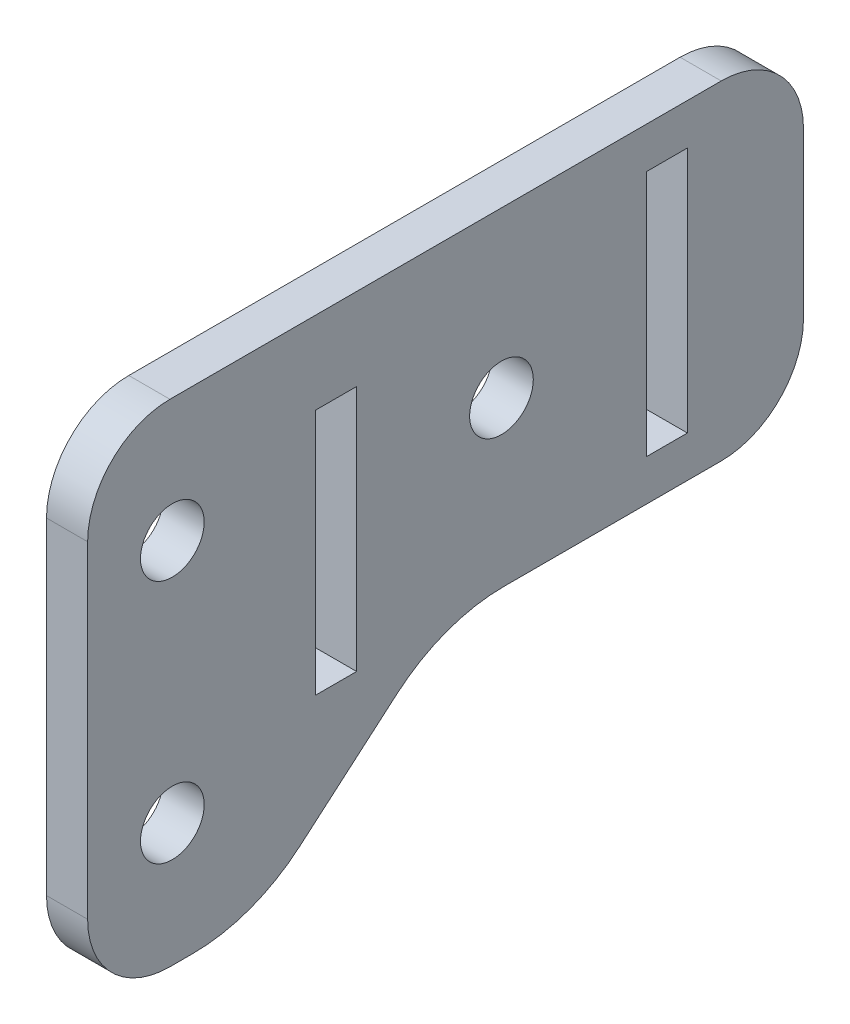
ISO-10303-21;
HEADER;
FILE_DESCRIPTION(('STEP AP214'),'2;1');
FILE_NAME('part.step','',(''),(''),'','','');
FILE_SCHEMA(('AUTOMOTIVE_DESIGN { 1 0 10303 214 1 1 1 1 }'));
ENDSEC;
DATA;
#1=APPLICATION_CONTEXT('core data for automotive mechanical design processes');
#2=APPLICATION_PROTOCOL_DEFINITION('international standard','automotive_design',2000,#1);
#3=PRODUCT_CONTEXT('',#1,'mechanical');
#4=PRODUCT('Part','Part','',(#3));
#5=PRODUCT_RELATED_PRODUCT_CATEGORY('part','',(#4));
#6=PRODUCT_DEFINITION_FORMATION('','',#4);
#7=PRODUCT_DEFINITION_CONTEXT('part definition',#1,'design');
#8=PRODUCT_DEFINITION('design','',#6,#7);
#9=PRODUCT_DEFINITION_SHAPE('','',#8);
#10=(LENGTH_UNIT() NAMED_UNIT(*) SI_UNIT(.MILLI.,.METRE.));
#11=(NAMED_UNIT(*) PLANE_ANGLE_UNIT() SI_UNIT($,.RADIAN.));
#12=(NAMED_UNIT(*) SI_UNIT($,.STERADIAN.) SOLID_ANGLE_UNIT());
#13=UNCERTAINTY_MEASURE_WITH_UNIT(LENGTH_MEASURE(1.E-05),#10,'distance_accuracy_value','');
#14=(GEOMETRIC_REPRESENTATION_CONTEXT(3) GLOBAL_UNCERTAINTY_ASSIGNED_CONTEXT((#13)) GLOBAL_UNIT_ASSIGNED_CONTEXT((#10,
#11,#12)) REPRESENTATION_CONTEXT('',''));
#15=CARTESIAN_POINT('',(0.,0.,0.));
#16=DIRECTION('',(0.,0.,1.));
#17=DIRECTION('',(1.,0.,0.));
#18=AXIS2_PLACEMENT_3D('',#15,#16,#17);
#19=CARTESIAN_POINT('',(3.175,17.2156788351446,31.9348602919418));
#20=DIRECTION('',(0.,0.,-1.));
#21=DIRECTION('',(0.,1.,0.));
#22=AXIS2_PLACEMENT_3D('',#19,#20,#21);
#23=PLANE('',#22);
#24=DIRECTION('',(0.,-1.,0.));
#25=VECTOR('',#24,1.);
#26=CARTESIAN_POINT('',(0.,17.2156788351446,31.9348602919418));
#27=LINE('',#26,#25);
#28=CARTESIAN_POINT('',(0.,10.8656788351446,31.9348602919418));
#29=VERTEX_POINT('',#28);
#30=CARTESIAN_POINT('',(0.,-14.3666811648554,31.9348602919418));
#31=VERTEX_POINT('',#30);
#32=EDGE_CURVE('E220',#29,#31,#27,.T.);
#33=ORIENTED_EDGE('',*,*,#32,.T.);
#34=DIRECTION('',(-1.,0.,0.));
#35=VECTOR('',#34,1.);
#36=CARTESIAN_POINT('',(3.175,-14.3666811648554,31.9348602919418));
#37=LINE('',#36,#35);
#38=CARTESIAN_POINT('',(3.175,-14.3666811648554,31.9348602919418));
#39=VERTEX_POINT('',#38);
#40=EDGE_CURVE('E11',#31,#39,#37,.F.);
#41=ORIENTED_EDGE('',*,*,#40,.T.);
#42=DIRECTION('',(0.,-1.,0.));
#43=VECTOR('',#42,1.);
#44=CARTESIAN_POINT('',(3.175,17.2156788351446,31.9348602919418));
#45=LINE('',#44,#43);
#46=CARTESIAN_POINT('',(3.175,10.8656788351446,31.9348602919418));
#47=VERTEX_POINT('',#46);
#48=EDGE_CURVE('E255',#47,#39,#45,.T.);
#49=ORIENTED_EDGE('',*,*,#48,.F.);
#50=DIRECTION('',(-1.,0.,0.));
#51=VECTOR('',#50,1.);
#52=CARTESIAN_POINT('',(3.175,10.8656788351446,31.9348602919418));
#53=LINE('',#52,#51);
#54=EDGE_CURVE('E45',#47,#29,#53,.T.);
#55=ORIENTED_EDGE('',*,*,#54,.T.);
#56=EDGE_LOOP('',(#33,#41,#49,#55));
#57=FACE_BOUND('',#56,.T.);
#58=ADVANCED_FACE('F37',(#57),#23,.F.);
#59=CARTESIAN_POINT('',(3.175,-20.7166811648554,23.8154632165909));
#60=DIRECTION('',(0.,1.,0.));
#61=DIRECTION('',(0.,0.,1.));
#62=AXIS2_PLACEMENT_3D('',#59,#60,#61);
#63=PLANE('',#62);
#64=DIRECTION('',(0.,0.,-1.));
#65=VECTOR('',#64,1.);
#66=CARTESIAN_POINT('',(3.175,-20.7166811648554,23.8154632165909));
#67=LINE('',#66,#65);
#68=CARTESIAN_POINT('',(3.175,-20.7166811648554,25.5848602919418));
#69=VERTEX_POINT('',#68);
#70=CARTESIAN_POINT('',(3.175,-20.7166811648554,23.8154632165909));
#71=VERTEX_POINT('',#70);
#72=EDGE_CURVE('E257',#69,#71,#67,.T.);
#73=ORIENTED_EDGE('',*,*,#72,.F.);
#74=DIRECTION('',(-1.,0.,0.));
#75=VECTOR('',#74,1.);
#76=CARTESIAN_POINT('',(3.175,-20.7166811648554,25.5848602919418));
#77=LINE('',#76,#75);
#78=CARTESIAN_POINT('',(0.,-20.7166811648554,25.5848602919418));
#79=VERTEX_POINT('',#78);
#80=EDGE_CURVE('E340',#69,#79,#77,.T.);
#81=ORIENTED_EDGE('',*,*,#80,.T.);
#82=DIRECTION('',(0.,0.,-1.));
#83=VECTOR('',#82,1.);
#84=CARTESIAN_POINT('',(0.,-20.7166811648554,23.8154632165909));
#85=LINE('',#84,#83);
#86=CARTESIAN_POINT('',(0.,-20.7166811648554,23.8154632165909));
#87=VERTEX_POINT('',#86);
#88=EDGE_CURVE('E280',#79,#87,#85,.T.);
#89=ORIENTED_EDGE('',*,*,#88,.T.);
#90=DIRECTION('',(-1.,0.,0.));
#91=VECTOR('',#90,1.);
#92=CARTESIAN_POINT('',(3.175,-20.7166811648554,23.8154632165909));
#93=LINE('',#92,#91);
#94=EDGE_CURVE('E308',#71,#87,#93,.T.);
#95=ORIENTED_EDGE('',*,*,#94,.F.);
#96=EDGE_LOOP('',(#73,#81,#89,#95));
#97=FACE_BOUND('',#96,.T.);
#98=ADVANCED_FACE('F382',(#97),#63,.F.);
#99=CARTESIAN_POINT('',(3.175,-8.01668116485543,23.8154632165909));
#100=DIRECTION('',(-1.,0.,0.));
#101=DIRECTION('',(0.,0.,1.));
#102=AXIS2_PLACEMENT_3D('',#99,#100,#101);
#103=CYLINDRICAL_SURFACE('',#102,12.7);
#104=CARTESIAN_POINT('',(0.,-8.01668116485543,23.8154632165909));
#105=DIRECTION('',(1.,0.,0.));
#106=DIRECTION('',(0.,0.,-1.));
#107=AXIS2_PLACEMENT_3D('',#104,#105,#106);
#108=CIRCLE('',#107,12.7);
#109=CARTESIAN_POINT('',(0.,-17.6547424695242,15.5451685248978));
#110=VERTEX_POINT('',#109);
#111=EDGE_CURVE('E283',#87,#110,#108,.T.);
#112=ORIENTED_EDGE('',*,*,#111,.T.);
#113=DIRECTION('',(-1.,0.,0.));
#114=VECTOR('',#113,1.);
#115=CARTESIAN_POINT('',(3.175,-17.6547424695242,15.5451685248978));
#116=LINE('',#115,#114);
#117=CARTESIAN_POINT('',(3.175,-17.6547424695242,15.5451685248978));
#118=VERTEX_POINT('',#117);
#119=EDGE_CURVE('E305',#118,#110,#116,.T.);
#120=ORIENTED_EDGE('',*,*,#119,.F.);
#121=CARTESIAN_POINT('',(3.175,-8.01668116485543,23.8154632165909));
#122=DIRECTION('',(1.,0.,0.));
#123=DIRECTION('',(0.,0.,-1.));
#124=AXIS2_PLACEMENT_3D('',#121,#122,#123);
#125=CIRCLE('',#124,12.7);
#126=EDGE_CURVE('E260',#71,#118,#125,.T.);
#127=ORIENTED_EDGE('',*,*,#126,.F.);
#128=ORIENTED_EDGE('',*,*,#94,.T.);
#129=EDGE_LOOP('',(#112,#120,#127,#128));
#130=FACE_BOUND('',#129,.T.);
#131=ADVANCED_FACE('F380',(#130),#103,.T.);
#132=CARTESIAN_POINT('',(3.175,-11.2462598601867,8.07683147510241));
#133=DIRECTION('',(0.,0.758902464934545,0.651204306432529));
#134=DIRECTION('',(0.,-0.651204306432529,0.758902464934545));
#135=AXIS2_PLACEMENT_3D('',#132,#133,#134);
#136=PLANE('',#135);
#137=DIRECTION('',(0.,0.651204306432529,-0.758902464934545));
#138=VECTOR('',#137,1.);
#139=CARTESIAN_POINT('',(0.,-11.2462598601867,8.07683147510241));
#140=LINE('',#139,#138);
#141=CARTESIAN_POINT('',(0.,-11.2462598601867,8.07683147510241));
#142=VERTEX_POINT('',#141);
#143=EDGE_CURVE('E286',#110,#142,#140,.T.);
#144=ORIENTED_EDGE('',*,*,#143,.T.);
#145=DIRECTION('',(-1.,0.,0.));
#146=VECTOR('',#145,1.);
#147=CARTESIAN_POINT('',(3.175,-11.2462598601867,8.07683147510241));
#148=LINE('',#147,#146);
#149=CARTESIAN_POINT('',(3.175,-11.2462598601867,8.07683147510241));
#150=VERTEX_POINT('',#149);
#151=EDGE_CURVE('E302',#150,#142,#148,.T.);
#152=ORIENTED_EDGE('',*,*,#151,.F.);
#153=DIRECTION('',(0.,0.651204306432529,-0.758902464934545));
#154=VECTOR('',#153,1.);
#155=CARTESIAN_POINT('',(3.175,-11.2462598601867,8.07683147510241));
#156=LINE('',#155,#154);
#157=EDGE_CURVE('E263',#118,#150,#156,.T.);
#158=ORIENTED_EDGE('',*,*,#157,.F.);
#159=ORIENTED_EDGE('',*,*,#119,.T.);
#160=EDGE_LOOP('',(#144,#152,#158,#159));
#161=FACE_BOUND('',#160,.T.);
#162=ADVANCED_FACE('F376',(#161),#136,.F.);
#163=CARTESIAN_POINT('',(3.175,-20.8843211648554,-0.193463216590709));
#164=DIRECTION('',(-1.,0.,0.));
#165=DIRECTION('',(0.,0.,1.));
#166=AXIS2_PLACEMENT_3D('',#163,#164,#165);
#167=CYLINDRICAL_SURFACE('',#166,12.7);
#168=CARTESIAN_POINT('',(0.,-20.8843211648554,-0.193463216590709));
#169=DIRECTION('',(-1.,0.,0.));
#170=DIRECTION('',(0.,0.,-1.));
#171=AXIS2_PLACEMENT_3D('',#168,#169,#170);
#172=CIRCLE('',#171,12.7);
#173=CARTESIAN_POINT('',(0.,-8.18432116485543,-0.193463216590736));
#174=VERTEX_POINT('',#173);
#175=EDGE_CURVE('E289',#142,#174,#172,.T.);
#176=ORIENTED_EDGE('',*,*,#175,.T.);
#177=DIRECTION('',(-1.,0.,0.));
#178=VECTOR('',#177,1.);
#179=CARTESIAN_POINT('',(3.175,-8.18432116485543,-0.193463216590736));
#180=LINE('',#179,#178);
#181=CARTESIAN_POINT('',(3.175,-8.18432116485543,-0.193463216590736));
#182=VERTEX_POINT('',#181);
#183=EDGE_CURVE('E277',#182,#174,#180,.T.);
#184=ORIENTED_EDGE('',*,*,#183,.F.);
#185=CARTESIAN_POINT('',(3.175,-20.8843211648554,-0.193463216590709));
#186=DIRECTION('',(-1.,0.,0.));
#187=DIRECTION('',(0.,0.,-1.));
#188=AXIS2_PLACEMENT_3D('',#185,#186,#187);
#189=CIRCLE('',#188,12.7);
#190=EDGE_CURVE('E266',#150,#182,#189,.T.);
#191=ORIENTED_EDGE('',*,*,#190,.F.);
#192=ORIENTED_EDGE('',*,*,#151,.T.);
#193=EDGE_LOOP('',(#176,#184,#191,#192));
#194=FACE_BOUND('',#193,.T.);
#195=ADVANCED_FACE('F373',(#194),#167,.F.);
#196=CARTESIAN_POINT('',(3.175,-8.18432116485543,-23.3101397080582));
#197=DIRECTION('',(0.,1.,0.));
#198=DIRECTION('',(0.,0.,1.));
#199=AXIS2_PLACEMENT_3D('',#196,#197,#198);
#200=PLANE('',#199);
#201=DIRECTION('',(0.,0.,-1.));
#202=VECTOR('',#201,1.);
#203=CARTESIAN_POINT('',(0.,-8.18432116485543,-23.3101397080582));
#204=LINE('',#203,#202);
#205=CARTESIAN_POINT('',(0.,-8.18432116485543,-16.9601397080582));
#206=VERTEX_POINT('',#205);
#207=EDGE_CURVE('E292',#174,#206,#204,.T.);
#208=ORIENTED_EDGE('',*,*,#207,.T.);
#209=DIRECTION('',(-1.,0.,0.));
#210=VECTOR('',#209,1.);
#211=CARTESIAN_POINT('',(3.175,-8.18432116485543,-16.9601397080582));
#212=LINE('',#211,#210);
#213=CARTESIAN_POINT('',(3.175,-8.18432116485543,-16.9601397080582));
#214=VERTEX_POINT('',#213);
#215=EDGE_CURVE('E337',#206,#214,#212,.F.);
#216=ORIENTED_EDGE('',*,*,#215,.T.);
#217=DIRECTION('',(0.,0.,-1.));
#218=VECTOR('',#217,1.);
#219=CARTESIAN_POINT('',(3.175,-8.18432116485543,-23.3101397080582));
#220=LINE('',#219,#218);
#221=EDGE_CURVE('E269',#182,#214,#220,.T.);
#222=ORIENTED_EDGE('',*,*,#221,.F.);
#223=ORIENTED_EDGE('',*,*,#183,.T.);
#224=EDGE_LOOP('',(#208,#216,#222,#223));
#225=FACE_BOUND('',#224,.T.);
#226=ADVANCED_FACE('F371',(#225),#200,.F.);
#227=CARTESIAN_POINT('',(3.175,-8.18432116485543,-23.3101397080582));
#228=DIRECTION('',(0.,0.,1.));
#229=DIRECTION('',(1.,0.,0.));
#230=AXIS2_PLACEMENT_3D('',#227,#228,#229);
#231=PLANE('',#230);
#232=DIRECTION('',(0.,1.,0.));
#233=VECTOR('',#232,1.);
#234=CARTESIAN_POINT('',(0.,-8.18432116485543,-23.3101397080582));
#235=LINE('',#234,#233);
#236=CARTESIAN_POINT('',(0.,-1.83432116485543,-23.3101397080582));
#237=VERTEX_POINT('',#236);
#238=CARTESIAN_POINT('',(0.,10.8656788351446,-23.3101397080582));
#239=VERTEX_POINT('',#238);
#240=EDGE_CURVE('E295',#237,#239,#235,.T.);
#241=ORIENTED_EDGE('',*,*,#240,.T.);
#242=DIRECTION('',(-1.,0.,0.));
#243=VECTOR('',#242,1.);
#244=CARTESIAN_POINT('',(3.175,10.8656788351446,-23.3101397080582));
#245=LINE('',#244,#243);
#246=CARTESIAN_POINT('',(3.175,10.8656788351446,-23.3101397080582));
#247=VERTEX_POINT('',#246);
#248=EDGE_CURVE('E328',#239,#247,#245,.F.);
#249=ORIENTED_EDGE('',*,*,#248,.T.);
#250=DIRECTION('',(0.,1.,0.));
#251=VECTOR('',#250,1.);
#252=CARTESIAN_POINT('',(3.175,-8.18432116485543,-23.3101397080582));
#253=LINE('',#252,#251);
#254=CARTESIAN_POINT('',(3.175,-1.83432116485543,-23.3101397080582));
#255=VERTEX_POINT('',#254);
#256=EDGE_CURVE('E271',#255,#247,#253,.T.);
#257=ORIENTED_EDGE('',*,*,#256,.F.);
#258=DIRECTION('',(-1.,0.,0.));
#259=VECTOR('',#258,1.);
#260=CARTESIAN_POINT('',(3.175,-1.83432116485543,-23.3101397080582));
#261=LINE('',#260,#259);
#262=EDGE_CURVE('E325',#255,#237,#261,.T.);
#263=ORIENTED_EDGE('',*,*,#262,.T.);
#264=EDGE_LOOP('',(#241,#249,#257,#263));
#265=FACE_BOUND('',#264,.T.);
#266=ADVANCED_FACE('F367',(#265),#231,.F.);
#267=CARTESIAN_POINT('',(3.175,17.2156788351446,31.9348602919418));
#268=DIRECTION('',(0.,-1.,0.));
#269=DIRECTION('',(0.,0.,-1.));
#270=AXIS2_PLACEMENT_3D('',#267,#268,#269);
#271=PLANE('',#270);
#272=DIRECTION('',(0.,0.,1.));
#273=VECTOR('',#272,1.);
#274=CARTESIAN_POINT('',(3.175,17.2156788351446,31.9348602919418));
#275=LINE('',#274,#273);
#276=CARTESIAN_POINT('',(3.175,17.2156788351446,-16.9601397080582));
#277=VERTEX_POINT('',#276);
#278=CARTESIAN_POINT('',(3.175,17.2156788351446,25.5848602919418));
#279=VERTEX_POINT('',#278);
#280=EDGE_CURVE('E274',#277,#279,#275,.T.);
#281=ORIENTED_EDGE('',*,*,#280,.F.);
#282=DIRECTION('',(-1.,0.,0.));
#283=VECTOR('',#282,1.);
#284=CARTESIAN_POINT('',(3.175,17.2156788351446,-16.9601397080582));
#285=LINE('',#284,#283);
#286=CARTESIAN_POINT('',(0.,17.2156788351446,-16.9601397080582));
#287=VERTEX_POINT('',#286);
#288=EDGE_CURVE('E314',#277,#287,#285,.T.);
#289=ORIENTED_EDGE('',*,*,#288,.T.);
#290=DIRECTION('',(0.,0.,1.));
#291=VECTOR('',#290,1.);
#292=CARTESIAN_POINT('',(0.,17.2156788351446,31.9348602919418));
#293=LINE('',#292,#291);
#294=CARTESIAN_POINT('',(0.,17.2156788351446,25.5848602919418));
#295=VERTEX_POINT('',#294);
#296=EDGE_CURVE('E258',#287,#295,#293,.T.);
#297=ORIENTED_EDGE('',*,*,#296,.T.);
#298=DIRECTION('',(-1.,0.,0.));
#299=VECTOR('',#298,1.);
#300=CARTESIAN_POINT('',(3.175,17.2156788351446,25.5848602919418));
#301=LINE('',#300,#299);
#302=EDGE_CURVE('E311',#295,#279,#301,.F.);
#303=ORIENTED_EDGE('',*,*,#302,.T.);
#304=EDGE_LOOP('',(#281,#289,#297,#303));
#305=FACE_BOUND('',#304,.T.);
#306=ADVANCED_FACE('F359',(#305),#271,.F.);
#307=CARTESIAN_POINT('',(3.175,-8.01668116485543,23.8154632165909));
#308=DIRECTION('',(1.,0.,0.));
#309=DIRECTION('',(0.,0.,-1.));
#310=AXIS2_PLACEMENT_3D('',#307,#308,#309);
#311=PLANE('',#310);
#312=CARTESIAN_POINT('',(3.175,7.69067883514458,25.4));
#313=DIRECTION('',(1.,0.,0.));
#314=DIRECTION('',(0.,0.,-1.));
#315=AXIS2_PLACEMENT_3D('',#312,#313,#314);
#316=CIRCLE('',#315,2.45744999999999);
#317=CARTESIAN_POINT('',(3.175,7.69067883514458,22.94255));
#318=VERTEX_POINT('',#317);
#319=EDGE_CURVE('E604',#318,#318,#316,.T.);
#320=ORIENTED_EDGE('',*,*,#319,.F.);
#321=EDGE_LOOP('',(#320));
#322=FACE_BOUND('',#321,.T.);
#323=CARTESIAN_POINT('',(3.175,-11.1916811648554,25.4));
#324=DIRECTION('',(1.,0.,0.));
#325=DIRECTION('',(0.,0.,-1.));
#326=AXIS2_PLACEMENT_3D('',#323,#324,#325);
#327=CIRCLE('',#326,2.45744999999999);
#328=CARTESIAN_POINT('',(3.175,-11.1916811648554,22.94255));
#329=VERTEX_POINT('',#328);
#330=EDGE_CURVE('E608',#329,#329,#327,.T.);
#331=ORIENTED_EDGE('',*,*,#330,.F.);
#332=EDGE_LOOP('',(#331));
#333=FACE_BOUND('',#332,.T.);
#334=CARTESIAN_POINT('',(3.175,4.51567883514458,0.));
#335=DIRECTION('',(1.,0.,0.));
#336=DIRECTION('',(0.,0.,-1.));
#337=AXIS2_PLACEMENT_3D('',#334,#335,#336);
#338=CIRCLE('',#337,2.45744999999999);
#339=CARTESIAN_POINT('',(3.175,4.51567883514458,-2.45744999999999));
#340=VERTEX_POINT('',#339);
#341=EDGE_CURVE('E207',#340,#340,#338,.T.);
#342=ORIENTED_EDGE('',*,*,#341,.F.);
#343=EDGE_LOOP('',(#342));
#344=FACE_BOUND('',#343,.T.);
#345=DIRECTION('',(0.,1.,0.));
#346=VECTOR('',#345,1.);
#347=CARTESIAN_POINT('',(3.175,14.0406788351446,-11.176));
#348=LINE('',#347,#346);
#349=CARTESIAN_POINT('',(3.175,-5.00932116485543,-11.176));
#350=VERTEX_POINT('',#349);
#351=CARTESIAN_POINT('',(3.175,14.0406788351446,-11.176));
#352=VERTEX_POINT('',#351);
#353=EDGE_CURVE('E180',#350,#352,#348,.T.);
#354=ORIENTED_EDGE('',*,*,#353,.T.);
#355=DIRECTION('',(0.,0.,-1.));
#356=VECTOR('',#355,1.);
#357=CARTESIAN_POINT('',(3.175,14.0406788351446,-11.176));
#358=LINE('',#357,#356);
#359=CARTESIAN_POINT('',(3.175,14.0406788351446,-14.351));
#360=VERTEX_POINT('',#359);
#361=EDGE_CURVE('E190',#352,#360,#358,.T.);
#362=ORIENTED_EDGE('',*,*,#361,.T.);
#363=DIRECTION('',(0.,-1.,0.));
#364=VECTOR('',#363,1.);
#365=CARTESIAN_POINT('',(3.175,-5.00932116485543,-14.351));
#366=LINE('',#365,#364);
#367=CARTESIAN_POINT('',(3.175,-5.00932116485543,-14.351));
#368=VERTEX_POINT('',#367);
#369=EDGE_CURVE('E195',#360,#368,#366,.T.);
#370=ORIENTED_EDGE('',*,*,#369,.T.);
#371=DIRECTION('',(0.,0.,1.));
#372=VECTOR('',#371,1.);
#373=CARTESIAN_POINT('',(3.175,-5.00932116485543,-11.176));
#374=LINE('',#373,#372);
#375=EDGE_CURVE('E187',#368,#350,#374,.T.);
#376=ORIENTED_EDGE('',*,*,#375,.T.);
#377=EDGE_LOOP('',(#354,#362,#370,#376));
#378=FACE_BOUND('',#377,.T.);
#379=DIRECTION('',(0.,1.,0.));
#380=VECTOR('',#379,1.);
#381=CARTESIAN_POINT('',(3.175,-8.18432116485535,14.351));
#382=LINE('',#381,#380);
#383=CARTESIAN_POINT('',(3.175,-8.18432116485535,14.351));
#384=VERTEX_POINT('',#383);
#385=CARTESIAN_POINT('',(3.175,10.8656788351446,14.351));
#386=VERTEX_POINT('',#385);
#387=EDGE_CURVE('E224',#384,#386,#382,.T.);
#388=ORIENTED_EDGE('',*,*,#387,.T.);
#389=DIRECTION('',(0.,0.,-1.));
#390=VECTOR('',#389,1.);
#391=CARTESIAN_POINT('',(3.175,10.8656788351446,14.351));
#392=LINE('',#391,#390);
#393=CARTESIAN_POINT('',(3.175,10.8656788351446,11.176));
#394=VERTEX_POINT('',#393);
#395=EDGE_CURVE('E227',#386,#394,#392,.T.);
#396=ORIENTED_EDGE('',*,*,#395,.T.);
#397=DIRECTION('',(0.,-1.,0.));
#398=VECTOR('',#397,1.);
#399=CARTESIAN_POINT('',(3.175,10.8656788351446,11.176));
#400=LINE('',#399,#398);
#401=CARTESIAN_POINT('',(3.175,-8.18432116485535,11.176));
#402=VERTEX_POINT('',#401);
#403=EDGE_CURVE('E231',#394,#402,#400,.T.);
#404=ORIENTED_EDGE('',*,*,#403,.T.);
#405=DIRECTION('',(0.,0.,1.));
#406=VECTOR('',#405,1.);
#407=CARTESIAN_POINT('',(3.175,-8.18432116485535,11.176));
#408=LINE('',#407,#406);
#409=EDGE_CURVE('E234',#402,#384,#408,.T.);
#410=ORIENTED_EDGE('',*,*,#409,.T.);
#411=EDGE_LOOP('',(#388,#396,#404,#410));
#412=FACE_BOUND('',#411,.T.);
#413=ORIENTED_EDGE('',*,*,#256,.T.);
#414=CARTESIAN_POINT('',(3.175,10.8656788351446,-16.9601397080582));
#415=DIRECTION('',(1.,0.,0.));
#416=DIRECTION('',(0.,0.,-1.));
#417=AXIS2_PLACEMENT_3D('',#414,#415,#416);
#418=CIRCLE('',#417,6.35);
#419=EDGE_CURVE('E335',#247,#277,#418,.T.);
#420=ORIENTED_EDGE('',*,*,#419,.T.);
#421=ORIENTED_EDGE('',*,*,#280,.T.);
#422=CARTESIAN_POINT('',(3.175,10.8656788351446,25.5848602919418));
#423=DIRECTION('',(1.,0.,0.));
#424=DIRECTION('',(0.,0.,-1.));
#425=AXIS2_PLACEMENT_3D('',#422,#423,#424);
#426=CIRCLE('',#425,6.35);
#427=EDGE_CURVE('E331',#279,#47,#426,.T.);
#428=ORIENTED_EDGE('',*,*,#427,.T.);
#429=ORIENTED_EDGE('',*,*,#48,.T.);
#430=CARTESIAN_POINT('',(3.175,-14.3666811648554,25.5848602919418));
#431=DIRECTION('',(1.,0.,0.));
#432=DIRECTION('',(0.,0.,-1.));
#433=AXIS2_PLACEMENT_3D('',#430,#431,#432);
#434=CIRCLE('',#433,6.35);
#435=EDGE_CURVE('E60',#39,#69,#434,.T.);
#436=ORIENTED_EDGE('',*,*,#435,.T.);
#437=ORIENTED_EDGE('',*,*,#72,.T.);
#438=ORIENTED_EDGE('',*,*,#126,.T.);
#439=ORIENTED_EDGE('',*,*,#157,.T.);
#440=ORIENTED_EDGE('',*,*,#190,.T.);
#441=ORIENTED_EDGE('',*,*,#221,.T.);
#442=CARTESIAN_POINT('',(3.175,-1.83432116485543,-16.9601397080582));
#443=DIRECTION('',(1.,0.,0.));
#444=DIRECTION('',(0.,0.,-1.));
#445=AXIS2_PLACEMENT_3D('',#442,#443,#444);
#446=CIRCLE('',#445,6.35);
#447=EDGE_CURVE('E52',#214,#255,#446,.T.);
#448=ORIENTED_EDGE('',*,*,#447,.T.);
#449=EDGE_LOOP('',(#413,#420,#421,#428,#429,#436,#437,#438,#439,#440,#441,#448));
#450=FACE_BOUND('',#449,.T.);
#451=ADVANCED_FACE('F198',(#322,#333,#344,#378,#412,#450),#311,.T.);
#452=CARTESIAN_POINT('',(0.,-8.01668116485543,23.8154632165909));
#453=DIRECTION('',(1.,0.,0.));
#454=DIRECTION('',(0.,0.,-1.));
#455=AXIS2_PLACEMENT_3D('',#452,#453,#454);
#456=PLANE('',#455);
#457=CARTESIAN_POINT('',(0.,7.69067883514458,25.4));
#458=DIRECTION('',(-1.,0.,0.));
#459=DIRECTION('',(0.,0.,1.));
#460=AXIS2_PLACEMENT_3D('',#457,#458,#459);
#461=CIRCLE('',#460,2.45744999999999);
#462=CARTESIAN_POINT('',(0.,7.69067883514458,27.85745));
#463=VERTEX_POINT('',#462);
#464=EDGE_CURVE('E621',#463,#463,#461,.T.);
#465=ORIENTED_EDGE('',*,*,#464,.F.);
#466=EDGE_LOOP('',(#465));
#467=FACE_BOUND('',#466,.T.);
#468=CARTESIAN_POINT('',(0.,-11.1916811648554,25.4));
#469=DIRECTION('',(-1.,0.,0.));
#470=DIRECTION('',(0.,0.,1.));
#471=AXIS2_PLACEMENT_3D('',#468,#469,#470);
#472=CIRCLE('',#471,2.45744999999999);
#473=CARTESIAN_POINT('',(0.,-11.1916811648554,27.85745));
#474=VERTEX_POINT('',#473);
#475=EDGE_CURVE('E615',#474,#474,#472,.T.);
#476=ORIENTED_EDGE('',*,*,#475,.F.);
#477=EDGE_LOOP('',(#476));
#478=FACE_BOUND('',#477,.T.);
#479=CARTESIAN_POINT('',(0.,4.51567883514458,0.));
#480=DIRECTION('',(-1.,0.,0.));
#481=DIRECTION('',(0.,0.,1.));
#482=AXIS2_PLACEMENT_3D('',#479,#480,#481);
#483=CIRCLE('',#482,2.45744999999999);
#484=CARTESIAN_POINT('',(0.,4.51567883514458,2.45744999999999));
#485=VERTEX_POINT('',#484);
#486=EDGE_CURVE('E611',#485,#485,#483,.T.);
#487=ORIENTED_EDGE('',*,*,#486,.F.);
#488=EDGE_LOOP('',(#487));
#489=FACE_BOUND('',#488,.T.);
#490=DIRECTION('',(0.,0.,-1.));
#491=VECTOR('',#490,1.);
#492=CARTESIAN_POINT('',(0.,14.0406788351446,-11.176));
#493=LINE('',#492,#491);
#494=CARTESIAN_POINT('',(0.,14.0406788351446,-11.176));
#495=VERTEX_POINT('',#494);
#496=CARTESIAN_POINT('',(0.,14.0406788351446,-14.351));
#497=VERTEX_POINT('',#496);
#498=EDGE_CURVE('E213',#495,#497,#493,.T.);
#499=ORIENTED_EDGE('',*,*,#498,.F.);
#500=DIRECTION('',(0.,1.,0.));
#501=VECTOR('',#500,1.);
#502=CARTESIAN_POINT('',(0.,14.0406788351446,-11.176));
#503=LINE('',#502,#501);
#504=CARTESIAN_POINT('',(0.,-5.00932116485543,-11.176));
#505=VERTEX_POINT('',#504);
#506=EDGE_CURVE('E182',#505,#495,#503,.T.);
#507=ORIENTED_EDGE('',*,*,#506,.F.);
#508=DIRECTION('',(0.,0.,1.));
#509=VECTOR('',#508,1.);
#510=CARTESIAN_POINT('',(0.,-5.00932116485543,-11.176));
#511=LINE('',#510,#509);
#512=CARTESIAN_POINT('',(0.,-5.00932116485543,-14.351));
#513=VERTEX_POINT('',#512);
#514=EDGE_CURVE('E201',#513,#505,#511,.T.);
#515=ORIENTED_EDGE('',*,*,#514,.F.);
#516=DIRECTION('',(0.,-1.,0.));
#517=VECTOR('',#516,1.);
#518=CARTESIAN_POINT('',(0.,-5.00932116485543,-14.351));
#519=LINE('',#518,#517);
#520=EDGE_CURVE('E204',#497,#513,#519,.T.);
#521=ORIENTED_EDGE('',*,*,#520,.F.);
#522=EDGE_LOOP('',(#499,#507,#515,#521));
#523=FACE_BOUND('',#522,.T.);
#524=DIRECTION('',(0.,0.,-1.));
#525=VECTOR('',#524,1.);
#526=CARTESIAN_POINT('',(0.,10.8656788351446,14.351));
#527=LINE('',#526,#525);
#528=CARTESIAN_POINT('',(0.,10.8656788351446,14.351));
#529=VERTEX_POINT('',#528);
#530=CARTESIAN_POINT('',(0.,10.8656788351446,11.176));
#531=VERTEX_POINT('',#530);
#532=EDGE_CURVE('E241',#529,#531,#527,.T.);
#533=ORIENTED_EDGE('',*,*,#532,.F.);
#534=DIRECTION('',(0.,1.,0.));
#535=VECTOR('',#534,1.);
#536=CARTESIAN_POINT('',(0.,-8.18432116485535,14.351));
#537=LINE('',#536,#535);
#538=CARTESIAN_POINT('',(0.,-8.18432116485535,14.351));
#539=VERTEX_POINT('',#538);
#540=EDGE_CURVE('E238',#539,#529,#537,.T.);
#541=ORIENTED_EDGE('',*,*,#540,.F.);
#542=DIRECTION('',(0.,0.,1.));
#543=VECTOR('',#542,1.);
#544=CARTESIAN_POINT('',(0.,-8.18432116485535,11.176));
#545=LINE('',#544,#543);
#546=CARTESIAN_POINT('',(0.,-8.18432116485535,11.176));
#547=VERTEX_POINT('',#546);
#548=EDGE_CURVE('E228',#547,#539,#545,.T.);
#549=ORIENTED_EDGE('',*,*,#548,.F.);
#550=DIRECTION('',(0.,-1.,0.));
#551=VECTOR('',#550,1.);
#552=CARTESIAN_POINT('',(0.,10.8656788351446,11.176));
#553=LINE('',#552,#551);
#554=EDGE_CURVE('E244',#531,#547,#553,.T.);
#555=ORIENTED_EDGE('',*,*,#554,.F.);
#556=EDGE_LOOP('',(#533,#541,#549,#555));
#557=FACE_BOUND('',#556,.T.);
#558=ORIENTED_EDGE('',*,*,#296,.F.);
#559=CARTESIAN_POINT('',(0.,10.8656788351446,-16.9601397080582));
#560=DIRECTION('',(1.,0.,0.));
#561=DIRECTION('',(0.,0.,-1.));
#562=AXIS2_PLACEMENT_3D('',#559,#560,#561);
#563=CIRCLE('',#562,6.35);
#564=EDGE_CURVE('E323',#287,#239,#563,.F.);
#565=ORIENTED_EDGE('',*,*,#564,.T.);
#566=ORIENTED_EDGE('',*,*,#240,.F.);
#567=CARTESIAN_POINT('',(0.,-1.83432116485543,-16.9601397080582));
#568=DIRECTION('',(1.,0.,0.));
#569=DIRECTION('',(0.,0.,-1.));
#570=AXIS2_PLACEMENT_3D('',#567,#568,#569);
#571=CIRCLE('',#570,6.35);
#572=EDGE_CURVE('E321',#237,#206,#571,.F.);
#573=ORIENTED_EDGE('',*,*,#572,.T.);
#574=ORIENTED_EDGE('',*,*,#207,.F.);
#575=ORIENTED_EDGE('',*,*,#175,.F.);
#576=ORIENTED_EDGE('',*,*,#143,.F.);
#577=ORIENTED_EDGE('',*,*,#111,.F.);
#578=ORIENTED_EDGE('',*,*,#88,.F.);
#579=CARTESIAN_POINT('',(0.,-14.3666811648554,25.5848602919418));
#580=DIRECTION('',(1.,0.,0.));
#581=DIRECTION('',(0.,0.,-1.));
#582=AXIS2_PLACEMENT_3D('',#579,#580,#581);
#583=CIRCLE('',#582,6.35);
#584=EDGE_CURVE('E319',#79,#31,#583,.F.);
#585=ORIENTED_EDGE('',*,*,#584,.T.);
#586=ORIENTED_EDGE('',*,*,#32,.F.);
#587=CARTESIAN_POINT('',(0.,10.8656788351446,25.5848602919418));
#588=DIRECTION('',(1.,0.,0.));
#589=DIRECTION('',(0.,0.,-1.));
#590=AXIS2_PLACEMENT_3D('',#587,#588,#589);
#591=CIRCLE('',#590,6.35);
#592=EDGE_CURVE('E317',#29,#295,#591,.F.);
#593=ORIENTED_EDGE('',*,*,#592,.T.);
#594=EDGE_LOOP('',(#558,#565,#566,#573,#574,#575,#576,#577,#578,#585,#586,#593));
#595=FACE_BOUND('',#594,.T.);
#596=ADVANCED_FACE('F350',(#467,#478,#489,#523,#557,#595),#456,.F.);
#597=CARTESIAN_POINT('',(3.175,-8.18432116485535,14.351));
#598=DIRECTION('',(0.,0.,1.));
#599=DIRECTION('',(0.,-1.,0.));
#600=AXIS2_PLACEMENT_3D('',#597,#598,#599);
#601=PLANE('',#600);
#602=ORIENTED_EDGE('',*,*,#540,.T.);
#603=DIRECTION('',(-1.,0.,0.));
#604=VECTOR('',#603,1.);
#605=CARTESIAN_POINT('',(3.175,10.8656788351446,14.351));
#606=LINE('',#605,#604);
#607=EDGE_CURVE('E237',#386,#529,#606,.T.);
#608=ORIENTED_EDGE('',*,*,#607,.F.);
#609=ORIENTED_EDGE('',*,*,#387,.F.);
#610=DIRECTION('',(-1.,0.,0.));
#611=VECTOR('',#610,1.);
#612=CARTESIAN_POINT('',(3.175,-8.18432116485535,14.351));
#613=LINE('',#612,#611);
#614=EDGE_CURVE('E214',#384,#539,#613,.T.);
#615=ORIENTED_EDGE('',*,*,#614,.T.);
#616=EDGE_LOOP('',(#602,#608,#609,#615));
#617=FACE_BOUND('',#616,.T.);
#618=ADVANCED_FACE('F514',(#617),#601,.F.);
#619=CARTESIAN_POINT('',(3.175,-8.18432116485535,11.176));
#620=DIRECTION('',(0.,-1.,0.));
#621=DIRECTION('',(0.,0.,-1.));
#622=AXIS2_PLACEMENT_3D('',#619,#620,#621);
#623=PLANE('',#622);
#624=ORIENTED_EDGE('',*,*,#548,.T.);
#625=ORIENTED_EDGE('',*,*,#614,.F.);
#626=ORIENTED_EDGE('',*,*,#409,.F.);
#627=DIRECTION('',(-1.,0.,0.));
#628=VECTOR('',#627,1.);
#629=CARTESIAN_POINT('',(3.175,-8.18432116485535,11.176));
#630=LINE('',#629,#628);
#631=EDGE_CURVE('E250',#402,#547,#630,.T.);
#632=ORIENTED_EDGE('',*,*,#631,.T.);
#633=EDGE_LOOP('',(#624,#625,#626,#632));
#634=FACE_BOUND('',#633,.T.);
#635=ADVANCED_FACE('F504',(#634),#623,.F.);
#636=CARTESIAN_POINT('',(3.175,10.8656788351446,11.176));
#637=DIRECTION('',(0.,0.,-1.));
#638=DIRECTION('',(0.,1.,0.));
#639=AXIS2_PLACEMENT_3D('',#636,#637,#638);
#640=PLANE('',#639);
#641=ORIENTED_EDGE('',*,*,#554,.T.);
#642=ORIENTED_EDGE('',*,*,#631,.F.);
#643=ORIENTED_EDGE('',*,*,#403,.F.);
#644=DIRECTION('',(-1.,0.,0.));
#645=VECTOR('',#644,1.);
#646=CARTESIAN_POINT('',(3.175,10.8656788351446,11.176));
#647=LINE('',#646,#645);
#648=EDGE_CURVE('E252',#394,#531,#647,.T.);
#649=ORIENTED_EDGE('',*,*,#648,.T.);
#650=EDGE_LOOP('',(#641,#642,#643,#649));
#651=FACE_BOUND('',#650,.T.);
#652=ADVANCED_FACE('F494',(#651),#640,.F.);
#653=CARTESIAN_POINT('',(3.175,10.8656788351446,14.351));
#654=DIRECTION('',(0.,1.,0.));
#655=DIRECTION('',(0.,0.,1.));
#656=AXIS2_PLACEMENT_3D('',#653,#654,#655);
#657=PLANE('',#656);
#658=ORIENTED_EDGE('',*,*,#532,.T.);
#659=ORIENTED_EDGE('',*,*,#648,.F.);
#660=ORIENTED_EDGE('',*,*,#395,.F.);
#661=ORIENTED_EDGE('',*,*,#607,.T.);
#662=EDGE_LOOP('',(#658,#659,#660,#661));
#663=FACE_BOUND('',#662,.T.);
#664=ADVANCED_FACE('F485',(#663),#657,.F.);
#665=CARTESIAN_POINT('',(3.175,14.0406788351446,-11.176));
#666=DIRECTION('',(0.,0.,1.));
#667=DIRECTION('',(0.,-1.,0.));
#668=AXIS2_PLACEMENT_3D('',#665,#666,#667);
#669=PLANE('',#668);
#670=ORIENTED_EDGE('',*,*,#506,.T.);
#671=DIRECTION('',(-1.,0.,0.));
#672=VECTOR('',#671,1.);
#673=CARTESIAN_POINT('',(3.175,14.0406788351446,-11.176));
#674=LINE('',#673,#672);
#675=EDGE_CURVE('E176',#352,#495,#674,.T.);
#676=ORIENTED_EDGE('',*,*,#675,.F.);
#677=ORIENTED_EDGE('',*,*,#353,.F.);
#678=DIRECTION('',(-1.,0.,0.));
#679=VECTOR('',#678,1.);
#680=CARTESIAN_POINT('',(3.175,-5.00932116485543,-11.176));
#681=LINE('',#680,#679);
#682=EDGE_CURVE('E218',#350,#505,#681,.T.);
#683=ORIENTED_EDGE('',*,*,#682,.T.);
#684=EDGE_LOOP('',(#670,#676,#677,#683));
#685=FACE_BOUND('',#684,.T.);
#686=ADVANCED_FACE('F178',(#685),#669,.F.);
#687=CARTESIAN_POINT('',(3.175,-5.00932116485543,-11.176));
#688=DIRECTION('',(0.,-1.,0.));
#689=DIRECTION('',(0.,0.,-1.));
#690=AXIS2_PLACEMENT_3D('',#687,#688,#689);
#691=PLANE('',#690);
#692=ORIENTED_EDGE('',*,*,#514,.T.);
#693=ORIENTED_EDGE('',*,*,#682,.F.);
#694=ORIENTED_EDGE('',*,*,#375,.F.);
#695=DIRECTION('',(-1.,0.,0.));
#696=VECTOR('',#695,1.);
#697=CARTESIAN_POINT('',(3.175,-5.00932116485543,-14.351));
#698=LINE('',#697,#696);
#699=EDGE_CURVE('E221',#368,#513,#698,.T.);
#700=ORIENTED_EDGE('',*,*,#699,.T.);
#701=EDGE_LOOP('',(#692,#693,#694,#700));
#702=FACE_BOUND('',#701,.T.);
#703=ADVANCED_FACE('F466',(#702),#691,.F.);
#704=CARTESIAN_POINT('',(3.175,-5.00932116485543,-14.351));
#705=DIRECTION('',(0.,0.,-1.));
#706=DIRECTION('',(-1.,0.,0.));
#707=AXIS2_PLACEMENT_3D('',#704,#705,#706);
#708=PLANE('',#707);
#709=ORIENTED_EDGE('',*,*,#520,.T.);
#710=ORIENTED_EDGE('',*,*,#699,.F.);
#711=ORIENTED_EDGE('',*,*,#369,.F.);
#712=DIRECTION('',(-1.,0.,0.));
#713=VECTOR('',#712,1.);
#714=CARTESIAN_POINT('',(3.175,14.0406788351446,-14.351));
#715=LINE('',#714,#713);
#716=EDGE_CURVE('E186',#360,#497,#715,.T.);
#717=ORIENTED_EDGE('',*,*,#716,.T.);
#718=EDGE_LOOP('',(#709,#710,#711,#717));
#719=FACE_BOUND('',#718,.T.);
#720=ADVANCED_FACE('F457',(#719),#708,.F.);
#721=CARTESIAN_POINT('',(3.175,14.0406788351446,-11.176));
#722=DIRECTION('',(0.,1.,0.));
#723=DIRECTION('',(0.,0.,1.));
#724=AXIS2_PLACEMENT_3D('',#721,#722,#723);
#725=PLANE('',#724);
#726=ORIENTED_EDGE('',*,*,#498,.T.);
#727=ORIENTED_EDGE('',*,*,#716,.F.);
#728=ORIENTED_EDGE('',*,*,#361,.F.);
#729=ORIENTED_EDGE('',*,*,#675,.T.);
#730=EDGE_LOOP('',(#726,#727,#728,#729));
#731=FACE_BOUND('',#730,.T.);
#732=ADVANCED_FACE('F191',(#731),#725,.F.);
#733=CARTESIAN_POINT('',(0.,4.51567883514458,0.));
#734=DIRECTION('',(-1.,0.,0.));
#735=DIRECTION('',(0.,0.,1.));
#736=AXIS2_PLACEMENT_3D('',#733,#734,#735);
#737=CYLINDRICAL_SURFACE('',#736,2.45744999999999);
#738=ORIENTED_EDGE('',*,*,#341,.T.);
#739=EDGE_LOOP('',(#738));
#740=FACE_BOUND('',#739,.T.);
#741=ORIENTED_EDGE('',*,*,#486,.T.);
#742=EDGE_LOOP('',(#741));
#743=FACE_BOUND('',#742,.T.);
#744=ADVANCED_FACE('F438',(#740,#743),#737,.F.);
#745=CARTESIAN_POINT('',(0.,-11.1916811648554,25.4));
#746=DIRECTION('',(-1.,0.,0.));
#747=DIRECTION('',(0.,0.,1.));
#748=AXIS2_PLACEMENT_3D('',#745,#746,#747);
#749=CYLINDRICAL_SURFACE('',#748,2.45744999999999);
#750=ORIENTED_EDGE('',*,*,#330,.T.);
#751=EDGE_LOOP('',(#750));
#752=FACE_BOUND('',#751,.T.);
#753=ORIENTED_EDGE('',*,*,#475,.T.);
#754=EDGE_LOOP('',(#753));
#755=FACE_BOUND('',#754,.T.);
#756=ADVANCED_FACE('F428',(#752,#755),#749,.F.);
#757=CARTESIAN_POINT('',(0.,7.69067883514458,25.4));
#758=DIRECTION('',(-1.,0.,0.));
#759=DIRECTION('',(0.,0.,1.));
#760=AXIS2_PLACEMENT_3D('',#757,#758,#759);
#761=CYLINDRICAL_SURFACE('',#760,2.45744999999999);
#762=ORIENTED_EDGE('',*,*,#319,.T.);
#763=EDGE_LOOP('',(#762));
#764=FACE_BOUND('',#763,.T.);
#765=ORIENTED_EDGE('',*,*,#464,.T.);
#766=EDGE_LOOP('',(#765));
#767=FACE_BOUND('',#766,.T.);
#768=ADVANCED_FACE('F395',(#764,#767),#761,.F.);
#769=CARTESIAN_POINT('',(3.175,10.8656788351446,-16.9601397080582));
#770=DIRECTION('',(-1.,0.,0.));
#771=DIRECTION('',(0.,0.,1.));
#772=AXIS2_PLACEMENT_3D('',#769,#770,#771);
#773=CYLINDRICAL_SURFACE('',#772,6.35);
#774=ORIENTED_EDGE('',*,*,#419,.F.);
#775=ORIENTED_EDGE('',*,*,#248,.F.);
#776=ORIENTED_EDGE('',*,*,#564,.F.);
#777=ORIENTED_EDGE('',*,*,#288,.F.);
#778=EDGE_LOOP('',(#774,#775,#776,#777));
#779=FACE_BOUND('',#778,.T.);
#780=ADVANCED_FACE('F364',(#779),#773,.T.);
#781=CARTESIAN_POINT('',(3.175,-1.83432116485543,-16.9601397080582));
#782=DIRECTION('',(-1.,0.,0.));
#783=DIRECTION('',(0.,0.,1.));
#784=AXIS2_PLACEMENT_3D('',#781,#782,#783);
#785=CYLINDRICAL_SURFACE('',#784,6.35);
#786=ORIENTED_EDGE('',*,*,#447,.F.);
#787=ORIENTED_EDGE('',*,*,#215,.F.);
#788=ORIENTED_EDGE('',*,*,#572,.F.);
#789=ORIENTED_EDGE('',*,*,#262,.F.);
#790=EDGE_LOOP('',(#786,#787,#788,#789));
#791=FACE_BOUND('',#790,.T.);
#792=ADVANCED_FACE('F368',(#791),#785,.T.);
#793=CARTESIAN_POINT('',(3.175,-14.3666811648554,25.5848602919418));
#794=DIRECTION('',(-1.,0.,0.));
#795=DIRECTION('',(0.,0.,1.));
#796=AXIS2_PLACEMENT_3D('',#793,#794,#795);
#797=CYLINDRICAL_SURFACE('',#796,6.35);
#798=ORIENTED_EDGE('',*,*,#435,.F.);
#799=ORIENTED_EDGE('',*,*,#40,.F.);
#800=ORIENTED_EDGE('',*,*,#584,.F.);
#801=ORIENTED_EDGE('',*,*,#80,.F.);
#802=EDGE_LOOP('',(#798,#799,#800,#801));
#803=FACE_BOUND('',#802,.T.);
#804=ADVANCED_FACE('F355',(#803),#797,.T.);
#805=CARTESIAN_POINT('',(3.175,10.8656788351446,25.5848602919418));
#806=DIRECTION('',(-1.,0.,0.));
#807=DIRECTION('',(0.,0.,1.));
#808=AXIS2_PLACEMENT_3D('',#805,#806,#807);
#809=CYLINDRICAL_SURFACE('',#808,6.35);
#810=ORIENTED_EDGE('',*,*,#427,.F.);
#811=ORIENTED_EDGE('',*,*,#302,.F.);
#812=ORIENTED_EDGE('',*,*,#592,.F.);
#813=ORIENTED_EDGE('',*,*,#54,.F.);
#814=EDGE_LOOP('',(#810,#811,#812,#813));
#815=FACE_BOUND('',#814,.T.);
#816=ADVANCED_FACE('F39',(#815),#809,.T.);
#817=CLOSED_SHELL('',(#58,#98,#131,#162,#195,#226,#266,#306,#451,#596,#618,#635,#652,#664,#686,
#703,#720,#732,#744,#756,#768,#780,#792,#804,#816));
#818=MANIFOLD_SOLID_BREP('B2',#817);
#819=ADVANCED_BREP_SHAPE_REPRESENTATION('',(#18,#818),#14);
#820=SHAPE_DEFINITION_REPRESENTATION(#9,#819);
ENDSEC;
END-ISO-10303-21;
